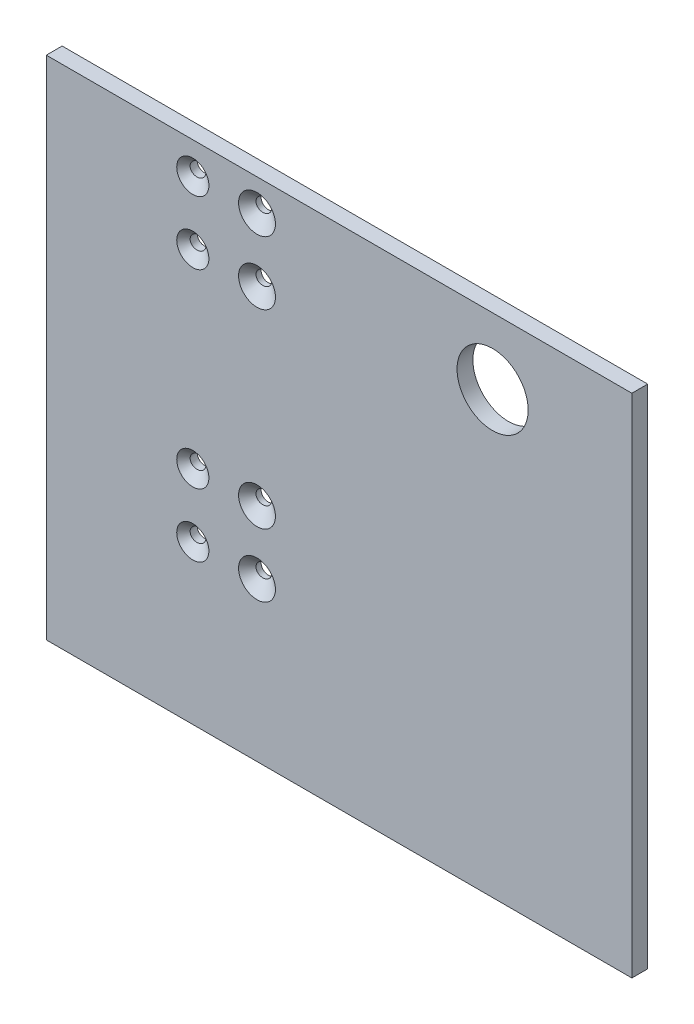
ISO-10303-21;
HEADER;
FILE_DESCRIPTION(('STEP AP214'),'2;1');
FILE_NAME('part.step','',(''),(''),'','','');
FILE_SCHEMA(('AUTOMOTIVE_DESIGN { 1 0 10303 214 1 1 1 1 }'));
ENDSEC;
DATA;
#1=APPLICATION_CONTEXT('core data for automotive mechanical design processes');
#2=APPLICATION_PROTOCOL_DEFINITION('international standard','automotive_design',2000,#1);
#3=PRODUCT_CONTEXT('',#1,'mechanical');
#4=PRODUCT('Part','Part','',(#3));
#5=PRODUCT_RELATED_PRODUCT_CATEGORY('part','',(#4));
#6=PRODUCT_DEFINITION_FORMATION('','',#4);
#7=PRODUCT_DEFINITION_CONTEXT('part definition',#1,'design');
#8=PRODUCT_DEFINITION('design','',#6,#7);
#9=PRODUCT_DEFINITION_SHAPE('','',#8);
#10=(LENGTH_UNIT() NAMED_UNIT(*) SI_UNIT(.MILLI.,.METRE.));
#11=(NAMED_UNIT(*) PLANE_ANGLE_UNIT() SI_UNIT($,.RADIAN.));
#12=(NAMED_UNIT(*) SI_UNIT($,.STERADIAN.) SOLID_ANGLE_UNIT());
#13=UNCERTAINTY_MEASURE_WITH_UNIT(LENGTH_MEASURE(1.E-05),#10,'distance_accuracy_value','');
#14=(GEOMETRIC_REPRESENTATION_CONTEXT(3) GLOBAL_UNCERTAINTY_ASSIGNED_CONTEXT((#13)) GLOBAL_UNIT_ASSIGNED_CONTEXT((#10,
#11,#12)) REPRESENTATION_CONTEXT('',''));
#15=CARTESIAN_POINT('',(0.,0.,0.));
#16=DIRECTION('',(0.,0.,1.));
#17=DIRECTION('',(1.,0.,0.));
#18=AXIS2_PLACEMENT_3D('',#15,#16,#17);
#19=CARTESIAN_POINT('',(117.475,-101.6,6.35));
#20=DIRECTION('',(-1.,0.,0.));
#21=DIRECTION('',(0.,0.,1.));
#22=AXIS2_PLACEMENT_3D('',#19,#20,#21);
#23=PLANE('',#22);
#24=DIRECTION('',(0.,1.,0.));
#25=VECTOR('',#24,1.);
#26=CARTESIAN_POINT('',(117.475,-101.6,0.));
#27=LINE('',#26,#25);
#28=CARTESIAN_POINT('',(117.475,-101.6,0.));
#29=VERTEX_POINT('',#28);
#30=CARTESIAN_POINT('',(117.475,101.6,0.));
#31=VERTEX_POINT('',#30);
#32=EDGE_CURVE('E107',#29,#31,#27,.T.);
#33=ORIENTED_EDGE('',*,*,#32,.T.);
#34=DIRECTION('',(0.,0.,-1.));
#35=VECTOR('',#34,1.);
#36=CARTESIAN_POINT('',(117.475,101.6,6.35));
#37=LINE('',#36,#35);
#38=CARTESIAN_POINT('',(117.475,101.6,6.35));
#39=VERTEX_POINT('',#38);
#40=EDGE_CURVE('E11',#39,#31,#37,.T.);
#41=ORIENTED_EDGE('',*,*,#40,.F.);
#42=DIRECTION('',(0.,1.,0.));
#43=VECTOR('',#42,1.);
#44=CARTESIAN_POINT('',(117.475,-101.6,6.35));
#45=LINE('',#44,#43);
#46=CARTESIAN_POINT('',(117.475,-101.6,6.35));
#47=VERTEX_POINT('',#46);
#48=EDGE_CURVE('E94',#47,#39,#45,.T.);
#49=ORIENTED_EDGE('',*,*,#48,.F.);
#50=DIRECTION('',(0.,0.,-1.));
#51=VECTOR('',#50,1.);
#52=CARTESIAN_POINT('',(117.475,-101.6,6.35));
#53=LINE('',#52,#51);
#54=EDGE_CURVE('E103',#47,#29,#53,.T.);
#55=ORIENTED_EDGE('',*,*,#54,.T.);
#56=EDGE_LOOP('',(#33,#41,#49,#55));
#57=FACE_BOUND('',#56,.T.);
#58=ADVANCED_FACE('F41',(#57),#23,.F.);
#59=CARTESIAN_POINT('',(-117.475,101.6,6.35));
#60=DIRECTION('',(0.,-1.,0.));
#61=DIRECTION('',(0.,0.,-1.));
#62=AXIS2_PLACEMENT_3D('',#59,#60,#61);
#63=PLANE('',#62);
#64=DIRECTION('',(-1.,0.,0.));
#65=VECTOR('',#64,1.);
#66=CARTESIAN_POINT('',(-117.475,101.6,0.));
#67=LINE('',#66,#65);
#68=CARTESIAN_POINT('',(-117.475,101.6,0.));
#69=VERTEX_POINT('',#68);
#70=EDGE_CURVE('E98',#31,#69,#67,.T.);
#71=ORIENTED_EDGE('',*,*,#70,.T.);
#72=DIRECTION('',(0.,0.,-1.));
#73=VECTOR('',#72,1.);
#74=CARTESIAN_POINT('',(-117.475,101.6,6.35));
#75=LINE('',#74,#73);
#76=CARTESIAN_POINT('',(-117.475,101.6,6.35));
#77=VERTEX_POINT('',#76);
#78=EDGE_CURVE('E50',#77,#69,#75,.T.);
#79=ORIENTED_EDGE('',*,*,#78,.F.);
#80=DIRECTION('',(-1.,0.,0.));
#81=VECTOR('',#80,1.);
#82=CARTESIAN_POINT('',(-117.475,101.6,6.35));
#83=LINE('',#82,#81);
#84=EDGE_CURVE('E89',#39,#77,#83,.T.);
#85=ORIENTED_EDGE('',*,*,#84,.F.);
#86=ORIENTED_EDGE('',*,*,#40,.T.);
#87=EDGE_LOOP('',(#71,#79,#85,#86));
#88=FACE_BOUND('',#87,.T.);
#89=ADVANCED_FACE('F97',(#88),#63,.F.);
#90=CARTESIAN_POINT('',(-117.475,-101.6,6.35));
#91=DIRECTION('',(1.,0.,0.));
#92=DIRECTION('',(0.,0.,-1.));
#93=AXIS2_PLACEMENT_3D('',#90,#91,#92);
#94=PLANE('',#93);
#95=DIRECTION('',(0.,-1.,0.));
#96=VECTOR('',#95,1.);
#97=CARTESIAN_POINT('',(-117.475,-101.6,0.));
#98=LINE('',#97,#96);
#99=CARTESIAN_POINT('',(-117.475,-101.6,0.));
#100=VERTEX_POINT('',#99);
#101=EDGE_CURVE('E76',#69,#100,#98,.T.);
#102=ORIENTED_EDGE('',*,*,#101,.T.);
#103=DIRECTION('',(0.,0.,-1.));
#104=VECTOR('',#103,1.);
#105=CARTESIAN_POINT('',(-117.475,-101.6,6.35));
#106=LINE('',#105,#104);
#107=CARTESIAN_POINT('',(-117.475,-101.6,6.35));
#108=VERTEX_POINT('',#107);
#109=EDGE_CURVE('E99',#108,#100,#106,.T.);
#110=ORIENTED_EDGE('',*,*,#109,.F.);
#111=DIRECTION('',(0.,-1.,0.));
#112=VECTOR('',#111,1.);
#113=CARTESIAN_POINT('',(-117.475,-101.6,6.35));
#114=LINE('',#113,#112);
#115=EDGE_CURVE('E92',#77,#108,#114,.T.);
#116=ORIENTED_EDGE('',*,*,#115,.F.);
#117=ORIENTED_EDGE('',*,*,#78,.T.);
#118=EDGE_LOOP('',(#102,#110,#116,#117));
#119=FACE_BOUND('',#118,.T.);
#120=ADVANCED_FACE('F101',(#119),#94,.F.);
#121=CARTESIAN_POINT('',(-117.475,-101.6,6.35));
#122=DIRECTION('',(0.,1.,0.));
#123=DIRECTION('',(0.,0.,1.));
#124=AXIS2_PLACEMENT_3D('',#121,#122,#123);
#125=PLANE('',#124);
#126=DIRECTION('',(1.,0.,0.));
#127=VECTOR('',#126,1.);
#128=CARTESIAN_POINT('',(-117.475,-101.6,0.));
#129=LINE('',#128,#127);
#130=EDGE_CURVE('E82',#100,#29,#129,.T.);
#131=ORIENTED_EDGE('',*,*,#130,.T.);
#132=ORIENTED_EDGE('',*,*,#54,.F.);
#133=DIRECTION('',(1.,0.,0.));
#134=VECTOR('',#133,1.);
#135=CARTESIAN_POINT('',(-117.475,-101.6,6.35));
#136=LINE('',#135,#134);
#137=EDGE_CURVE('E59',#108,#47,#136,.T.);
#138=ORIENTED_EDGE('',*,*,#137,.F.);
#139=ORIENTED_EDGE('',*,*,#109,.T.);
#140=EDGE_LOOP('',(#131,#132,#138,#139));
#141=FACE_BOUND('',#140,.T.);
#142=ADVANCED_FACE('F199',(#141),#125,.F.);
#143=CARTESIAN_POINT('',(0.,0.,6.35));
#144=DIRECTION('',(0.,0.,-1.));
#145=DIRECTION('',(-1.,0.,0.));
#146=AXIS2_PLACEMENT_3D('',#143,#144,#145);
#147=PLANE('',#146);
#148=CARTESIAN_POINT('',(-32.9289390059035,-12.6999999999791,6.35));
#149=DIRECTION('',(0.,0.,-1.));
#150=DIRECTION('',(1.,0.,0.));
#151=AXIS2_PLACEMENT_3D('',#148,#149,#150);
#152=ELLIPSE('',#151,7.39481340715656,7.25902315022984);
#153=CARTESIAN_POINT('',(-25.5341255987469,-12.6999999999791,6.35));
#154=VERTEX_POINT('',#153);
#155=EDGE_CURVE('E44',#154,#154,#152,.T.);
#156=ORIENTED_EDGE('',*,*,#155,.T.);
#157=EDGE_LOOP('',(#156));
#158=FACE_BOUND('',#157,.T.);
#159=CARTESIAN_POINT('',(-32.9289390059035,-38.0999999999791,6.35));
#160=DIRECTION('',(0.,0.,-1.));
#161=DIRECTION('',(1.,0.,0.));
#162=AXIS2_PLACEMENT_3D('',#159,#160,#161);
#163=ELLIPSE('',#162,7.39481340715651,7.25902315022979);
#164=CARTESIAN_POINT('',(-25.534125598747,-38.0999999999791,6.35));
#165=VERTEX_POINT('',#164);
#166=EDGE_CURVE('E162',#165,#165,#163,.T.);
#167=ORIENTED_EDGE('',*,*,#166,.T.);
#168=EDGE_LOOP('',(#167));
#169=FACE_BOUND('',#168,.T.);
#170=CARTESIAN_POINT('',(-32.9289390059034,63.5000000000017,6.35));
#171=DIRECTION('',(0.,0.,-1.));
#172=DIRECTION('',(1.,0.,0.));
#173=AXIS2_PLACEMENT_3D('',#170,#171,#172);
#174=ELLIPSE('',#173,7.39481340715672,7.25902315023);
#175=CARTESIAN_POINT('',(-25.5341255987467,63.5000000000017,6.35));
#176=VERTEX_POINT('',#175);
#177=EDGE_CURVE('E155',#176,#176,#174,.T.);
#178=ORIENTED_EDGE('',*,*,#177,.T.);
#179=EDGE_LOOP('',(#178));
#180=FACE_BOUND('',#179,.T.);
#181=CARTESIAN_POINT('',(-32.9289390059034,88.9000000000018,6.35));
#182=DIRECTION('',(0.,0.,-1.));
#183=DIRECTION('',(1.,0.,0.));
#184=AXIS2_PLACEMENT_3D('',#181,#182,#183);
#185=ELLIPSE('',#184,7.39481340715677,7.25902315023005);
#186=CARTESIAN_POINT('',(-25.5341255987467,88.9000000000018,6.35));
#187=VERTEX_POINT('',#186);
#188=EDGE_CURVE('E148',#187,#187,#185,.T.);
#189=ORIENTED_EDGE('',*,*,#188,.T.);
#190=EDGE_LOOP('',(#189));
#191=FACE_BOUND('',#190,.T.);
#192=CARTESIAN_POINT('',(-58.6916695251732,-38.0999999999791,6.35));
#193=DIRECTION('',(0.,0.,-1.));
#194=DIRECTION('',(1.,0.,0.));
#195=AXIS2_PLACEMENT_3D('',#192,#193,#194);
#196=ELLIPSE('',#195,6.45115062140423,6.3326887546713);
#197=CARTESIAN_POINT('',(-52.240518903769,-38.0999999999791,6.35));
#198=VERTEX_POINT('',#197);
#199=EDGE_CURVE('E141',#198,#198,#196,.T.);
#200=ORIENTED_EDGE('',*,*,#199,.T.);
#201=EDGE_LOOP('',(#200));
#202=FACE_BOUND('',#201,.T.);
#203=CARTESIAN_POINT('',(-58.6916695251732,-12.6999999999791,6.35));
#204=DIRECTION('',(0.,0.,-1.));
#205=DIRECTION('',(1.,0.,0.));
#206=AXIS2_PLACEMENT_3D('',#203,#204,#205);
#207=ELLIPSE('',#206,6.45115062140428,6.33268875467135);
#208=CARTESIAN_POINT('',(-52.2405189037689,-12.6999999999791,6.35));
#209=VERTEX_POINT('',#208);
#210=EDGE_CURVE('E134',#209,#209,#207,.T.);
#211=ORIENTED_EDGE('',*,*,#210,.T.);
#212=EDGE_LOOP('',(#211));
#213=FACE_BOUND('',#212,.T.);
#214=CARTESIAN_POINT('',(-58.6916695251731,63.5000000000017,6.35));
#215=DIRECTION('',(0.,0.,-1.));
#216=DIRECTION('',(1.,0.,0.));
#217=AXIS2_PLACEMENT_3D('',#214,#215,#216);
#218=ELLIPSE('',#217,6.45115062140444,6.33268875467151);
#219=CARTESIAN_POINT('',(-52.2405189037687,63.5000000000017,6.35));
#220=VERTEX_POINT('',#219);
#221=EDGE_CURVE('E127',#220,#220,#218,.T.);
#222=ORIENTED_EDGE('',*,*,#221,.T.);
#223=EDGE_LOOP('',(#222));
#224=FACE_BOUND('',#223,.T.);
#225=CARTESIAN_POINT('',(-58.6916695251731,88.9000000000017,6.35));
#226=DIRECTION('',(0.,0.,-1.));
#227=DIRECTION('',(1.,0.,0.));
#228=AXIS2_PLACEMENT_3D('',#225,#226,#227);
#229=ELLIPSE('',#228,6.45115062140449,6.33268875467156);
#230=CARTESIAN_POINT('',(-52.2405189037686,88.9000000000017,6.35));
#231=VERTEX_POINT('',#230);
#232=EDGE_CURVE('E116',#231,#231,#229,.T.);
#233=ORIENTED_EDGE('',*,*,#232,.T.);
#234=EDGE_LOOP('',(#233));
#235=FACE_BOUND('',#234,.T.);
#236=CARTESIAN_POINT('',(61.595,74.93,6.35));
#237=DIRECTION('',(0.,0.,1.));
#238=DIRECTION('',(1.,0.,0.));
#239=AXIS2_PLACEMENT_3D('',#236,#237,#238);
#240=CIRCLE('',#239,14.2748);
#241=CARTESIAN_POINT('',(75.8698,74.93,6.35));
#242=VERTEX_POINT('',#241);
#243=EDGE_CURVE('E123',#242,#242,#240,.T.);
#244=ORIENTED_EDGE('',*,*,#243,.F.);
#245=EDGE_LOOP('',(#244));
#246=FACE_BOUND('',#245,.T.);
#247=ORIENTED_EDGE('',*,*,#48,.T.);
#248=ORIENTED_EDGE('',*,*,#84,.T.);
#249=ORIENTED_EDGE('',*,*,#115,.T.);
#250=ORIENTED_EDGE('',*,*,#137,.T.);
#251=EDGE_LOOP('',(#247,#248,#249,#250));
#252=FACE_BOUND('',#251,.T.);
#253=ADVANCED_FACE('F90',(#158,#169,#180,#191,#202,#213,#224,#235,#246,#252),#147,.F.);
#254=CARTESIAN_POINT('',(0.,0.,0.));
#255=DIRECTION('',(0.,0.,-1.));
#256=DIRECTION('',(-1.,0.,0.));
#257=AXIS2_PLACEMENT_3D('',#254,#255,#256);
#258=PLANE('',#257);
#259=CARTESIAN_POINT('',(-34.8000253723395,-12.6999999999791,0.));
#260=DIRECTION('',(0.,0.,-1.));
#261=DIRECTION('',(1.,0.,0.));
#262=AXIS2_PLACEMENT_3D('',#259,#260,#261);
#263=ELLIPSE('',#262,2.83258676501395,2.80669999999999);
#264=CARTESIAN_POINT('',(-31.9674386073256,-12.6999999999791,0.));
#265=VERTEX_POINT('',#264);
#266=EDGE_CURVE('E165',#265,#265,#263,.T.);
#267=ORIENTED_EDGE('',*,*,#266,.F.);
#268=EDGE_LOOP('',(#267));
#269=FACE_BOUND('',#268,.T.);
#270=CARTESIAN_POINT('',(-34.8000253723395,-38.0999999999791,0.));
#271=DIRECTION('',(0.,0.,-1.));
#272=DIRECTION('',(1.,0.,0.));
#273=AXIS2_PLACEMENT_3D('',#270,#271,#272);
#274=ELLIPSE('',#273,2.83258676501395,2.80669999999999);
#275=CARTESIAN_POINT('',(-31.9674386073256,-38.0999999999791,0.));
#276=VERTEX_POINT('',#275);
#277=EDGE_CURVE('E159',#276,#276,#274,.T.);
#278=ORIENTED_EDGE('',*,*,#277,.F.);
#279=EDGE_LOOP('',(#278));
#280=FACE_BOUND('',#279,.T.);
#281=CARTESIAN_POINT('',(-34.8000253723395,63.5000000000017,0.));
#282=DIRECTION('',(0.,0.,-1.));
#283=DIRECTION('',(1.,0.,0.));
#284=AXIS2_PLACEMENT_3D('',#281,#282,#283);
#285=ELLIPSE('',#284,2.83258676501395,2.8067);
#286=CARTESIAN_POINT('',(-31.9674386073255,63.5000000000017,0.));
#287=VERTEX_POINT('',#286);
#288=EDGE_CURVE('E152',#287,#287,#285,.T.);
#289=ORIENTED_EDGE('',*,*,#288,.F.);
#290=EDGE_LOOP('',(#289));
#291=FACE_BOUND('',#290,.T.);
#292=CARTESIAN_POINT('',(-34.8000253723395,88.9000000000018,0.));
#293=DIRECTION('',(0.,0.,-1.));
#294=DIRECTION('',(1.,0.,0.));
#295=AXIS2_PLACEMENT_3D('',#292,#293,#294);
#296=ELLIPSE('',#295,2.83258676501395,2.8067);
#297=CARTESIAN_POINT('',(-31.9674386073255,88.9000000000018,0.));
#298=VERTEX_POINT('',#297);
#299=EDGE_CURVE('E145',#298,#298,#296,.T.);
#300=ORIENTED_EDGE('',*,*,#299,.F.);
#301=EDGE_LOOP('',(#300));
#302=FACE_BOUND('',#301,.T.);
#303=CARTESIAN_POINT('',(-60.4342947389817,-38.0999999999791,0.));
#304=DIRECTION('',(0.,0.,-1.));
#305=DIRECTION('',(1.,0.,0.));
#306=AXIS2_PLACEMENT_3D('',#303,#304,#305);
#307=ELLIPSE('',#306,2.83258676501395,2.80669999999999);
#308=CARTESIAN_POINT('',(-57.6017079739677,-38.0999999999791,0.));
#309=VERTEX_POINT('',#308);
#310=EDGE_CURVE('E138',#309,#309,#307,.T.);
#311=ORIENTED_EDGE('',*,*,#310,.F.);
#312=EDGE_LOOP('',(#311));
#313=FACE_BOUND('',#312,.T.);
#314=CARTESIAN_POINT('',(-60.4342947389816,-12.6999999999791,0.));
#315=DIRECTION('',(0.,0.,-1.));
#316=DIRECTION('',(1.,0.,0.));
#317=AXIS2_PLACEMENT_3D('',#314,#315,#316);
#318=ELLIPSE('',#317,2.83258676501395,2.80669999999999);
#319=CARTESIAN_POINT('',(-57.6017079739677,-12.6999999999791,0.));
#320=VERTEX_POINT('',#319);
#321=EDGE_CURVE('E131',#320,#320,#318,.T.);
#322=ORIENTED_EDGE('',*,*,#321,.F.);
#323=EDGE_LOOP('',(#322));
#324=FACE_BOUND('',#323,.T.);
#325=CARTESIAN_POINT('',(-60.4342947389816,63.5000000000017,0.));
#326=DIRECTION('',(0.,0.,-1.));
#327=DIRECTION('',(1.,0.,0.));
#328=AXIS2_PLACEMENT_3D('',#325,#326,#327);
#329=ELLIPSE('',#328,2.83258676501395,2.8067);
#330=CARTESIAN_POINT('',(-57.6017079739677,63.5000000000017,0.));
#331=VERTEX_POINT('',#330);
#332=EDGE_CURVE('E124',#331,#331,#329,.T.);
#333=ORIENTED_EDGE('',*,*,#332,.F.);
#334=EDGE_LOOP('',(#333));
#335=FACE_BOUND('',#334,.T.);
#336=CARTESIAN_POINT('',(-60.4342947389816,88.9000000000017,0.));
#337=DIRECTION('',(0.,0.,-1.));
#338=DIRECTION('',(1.,0.,0.));
#339=AXIS2_PLACEMENT_3D('',#336,#337,#338);
#340=ELLIPSE('',#339,2.83258676501395,2.8067);
#341=CARTESIAN_POINT('',(-57.6017079739677,88.9000000000017,0.));
#342=VERTEX_POINT('',#341);
#343=EDGE_CURVE('E119',#342,#342,#340,.T.);
#344=ORIENTED_EDGE('',*,*,#343,.F.);
#345=EDGE_LOOP('',(#344));
#346=FACE_BOUND('',#345,.T.);
#347=CARTESIAN_POINT('',(61.595,74.93,0.));
#348=DIRECTION('',(0.,0.,1.));
#349=DIRECTION('',(1.,0.,0.));
#350=AXIS2_PLACEMENT_3D('',#347,#348,#349);
#351=CIRCLE('',#350,14.2748);
#352=CARTESIAN_POINT('',(75.8698,74.93,0.));
#353=VERTEX_POINT('',#352);
#354=EDGE_CURVE('E110',#353,#353,#351,.T.);
#355=ORIENTED_EDGE('',*,*,#354,.T.);
#356=EDGE_LOOP('',(#355));
#357=FACE_BOUND('',#356,.T.);
#358=ORIENTED_EDGE('',*,*,#32,.F.);
#359=ORIENTED_EDGE('',*,*,#130,.F.);
#360=ORIENTED_EDGE('',*,*,#101,.F.);
#361=ORIENTED_EDGE('',*,*,#70,.F.);
#362=EDGE_LOOP('',(#358,#359,#360,#361));
#363=FACE_BOUND('',#362,.T.);
#364=ADVANCED_FACE('F198',(#269,#280,#291,#302,#313,#324,#335,#346,#357,#363),#258,.T.);
#365=CARTESIAN_POINT('',(61.595,74.93,0.));
#366=DIRECTION('',(0.,0.,1.));
#367=DIRECTION('',(1.,0.,0.));
#368=AXIS2_PLACEMENT_3D('',#365,#366,#367);
#369=CYLINDRICAL_SURFACE('',#368,14.2748);
#370=ORIENTED_EDGE('',*,*,#354,.F.);
#371=EDGE_LOOP('',(#370));
#372=FACE_BOUND('',#371,.T.);
#373=ORIENTED_EDGE('',*,*,#243,.T.);
#374=EDGE_LOOP('',(#373));
#375=FACE_BOUND('',#374,.T.);
#376=ADVANCED_FACE('F195',(#372,#375),#369,.F.);
#377=CARTESIAN_POINT('',(-59.2169690438166,88.9000000000017,8.9423528683234));
#378=DIRECTION('',(0.134886274213767,0.,0.990861086645716));
#379=DIRECTION('',(0.990861086645716,0.,-0.134886274213767));
#380=AXIS2_PLACEMENT_3D('',#377,#378,#379);
#381=CONICAL_SURFACE('',#380,8.89,0.785398163397448);
#382=CARTESIAN_POINT('',(-60.0375227157412,88.9000000000017,2.91464761993152));
#383=DIRECTION('',(0.134886274213767,0.,0.990861086645716));
#384=DIRECTION('',(0.990861086645716,0.,-0.134886274213767));
#385=AXIS2_PLACEMENT_3D('',#382,#383,#384);
#386=CIRCLE('',#385,2.8067);
#387=CARTESIAN_POINT('',(-57.2564729038527,88.9000000000017,2.53606231409574));
#388=VERTEX_POINT('',#387);
#389=EDGE_CURVE('E120',#388,#388,#386,.T.);
#390=ORIENTED_EDGE('',*,*,#389,.F.);
#391=EDGE_LOOP('',(#390));
#392=FACE_BOUND('',#391,.T.);
#393=ORIENTED_EDGE('',*,*,#232,.F.);
#394=EDGE_LOOP('',(#393));
#395=FACE_BOUND('',#394,.T.);
#396=ADVANCED_FACE('F237',(#392,#395),#381,.F.);
#397=CARTESIAN_POINT('',(-59.2169690438166,88.9000000000017,8.9423528683234));
#398=DIRECTION('',(0.134886274213767,0.,0.990861086645716));
#399=DIRECTION('',(0.990861086645716,0.,-0.134886274213767));
#400=AXIS2_PLACEMENT_3D('',#397,#398,#399);
#401=CYLINDRICAL_SURFACE('',#400,2.8067);
#402=ORIENTED_EDGE('',*,*,#343,.T.);
#403=EDGE_LOOP('',(#402));
#404=FACE_BOUND('',#403,.T.);
#405=ORIENTED_EDGE('',*,*,#389,.T.);
#406=EDGE_LOOP('',(#405));
#407=FACE_BOUND('',#406,.T.);
#408=ADVANCED_FACE('F246',(#404,#407),#401,.F.);
#409=CARTESIAN_POINT('',(-59.2169690438166,63.5000000000017,8.94235286832345));
#410=DIRECTION('',(0.134886274213767,0.,0.990861086645716));
#411=DIRECTION('',(0.990861086645716,0.,-0.134886274213767));
#412=AXIS2_PLACEMENT_3D('',#409,#410,#411);
#413=CONICAL_SURFACE('',#412,8.89,0.785398163397448);
#414=CARTESIAN_POINT('',(-60.0375227157412,63.5000000000017,2.91464761993157));
#415=DIRECTION('',(0.134886274213767,0.,0.990861086645716));
#416=DIRECTION('',(0.990861086645716,0.,-0.134886274213767));
#417=AXIS2_PLACEMENT_3D('',#414,#415,#416);
#418=CIRCLE('',#417,2.8067);
#419=CARTESIAN_POINT('',(-57.2564729038527,63.5000000000017,2.53606231409579));
#420=VERTEX_POINT('',#419);
#421=EDGE_CURVE('E128',#420,#420,#418,.T.);
#422=ORIENTED_EDGE('',*,*,#421,.F.);
#423=EDGE_LOOP('',(#422));
#424=FACE_BOUND('',#423,.T.);
#425=ORIENTED_EDGE('',*,*,#221,.F.);
#426=EDGE_LOOP('',(#425));
#427=FACE_BOUND('',#426,.T.);
#428=ADVANCED_FACE('F255',(#424,#427),#413,.F.);
#429=CARTESIAN_POINT('',(-59.2169690438166,63.5000000000017,8.94235286832345));
#430=DIRECTION('',(0.134886274213767,0.,0.990861086645716));
#431=DIRECTION('',(0.990861086645716,0.,-0.134886274213767));
#432=AXIS2_PLACEMENT_3D('',#429,#430,#431);
#433=CYLINDRICAL_SURFACE('',#432,2.8067);
#434=ORIENTED_EDGE('',*,*,#332,.T.);
#435=EDGE_LOOP('',(#434));
#436=FACE_BOUND('',#435,.T.);
#437=ORIENTED_EDGE('',*,*,#421,.T.);
#438=EDGE_LOOP('',(#437));
#439=FACE_BOUND('',#438,.T.);
#440=ADVANCED_FACE('F264',(#436,#439),#433,.F.);
#441=CARTESIAN_POINT('',(-59.2169690438166,-12.6999999999791,8.94235286832361));
#442=DIRECTION('',(0.134886274213767,0.,0.990861086645716));
#443=DIRECTION('',(0.990861086645716,0.,-0.134886274213767));
#444=AXIS2_PLACEMENT_3D('',#441,#442,#443);
#445=CONICAL_SURFACE('',#444,8.89,0.785398163397449);
#446=CARTESIAN_POINT('',(-60.0375227157412,-12.6999999999791,2.91464761993173));
#447=DIRECTION('',(0.134886274213767,0.,0.990861086645716));
#448=DIRECTION('',(0.990861086645716,0.,-0.134886274213767));
#449=AXIS2_PLACEMENT_3D('',#446,#447,#448);
#450=CIRCLE('',#449,2.80669999999999);
#451=CARTESIAN_POINT('',(-57.2564729038527,-12.6999999999791,2.53606231409595));
#452=VERTEX_POINT('',#451);
#453=EDGE_CURVE('E135',#452,#452,#450,.T.);
#454=ORIENTED_EDGE('',*,*,#453,.F.);
#455=EDGE_LOOP('',(#454));
#456=FACE_BOUND('',#455,.T.);
#457=ORIENTED_EDGE('',*,*,#210,.F.);
#458=EDGE_LOOP('',(#457));
#459=FACE_BOUND('',#458,.T.);
#460=ADVANCED_FACE('F273',(#456,#459),#445,.F.);
#461=CARTESIAN_POINT('',(-59.2169690438166,-12.6999999999791,8.94235286832361));
#462=DIRECTION('',(0.134886274213767,0.,0.990861086645716));
#463=DIRECTION('',(0.990861086645716,0.,-0.134886274213767));
#464=AXIS2_PLACEMENT_3D('',#461,#462,#463);
#465=CYLINDRICAL_SURFACE('',#464,2.80669999999999);
#466=ORIENTED_EDGE('',*,*,#321,.T.);
#467=EDGE_LOOP('',(#466));
#468=FACE_BOUND('',#467,.T.);
#469=ORIENTED_EDGE('',*,*,#453,.T.);
#470=EDGE_LOOP('',(#469));
#471=FACE_BOUND('',#470,.T.);
#472=ADVANCED_FACE('F282',(#468,#471),#465,.F.);
#473=CARTESIAN_POINT('',(-59.2169690438166,-38.0999999999791,8.94235286832366));
#474=DIRECTION('',(0.134886274213767,0.,0.990861086645716));
#475=DIRECTION('',(0.990861086645716,0.,-0.134886274213767));
#476=AXIS2_PLACEMENT_3D('',#473,#474,#475);
#477=CONICAL_SURFACE('',#476,8.89,0.785398163397449);
#478=CARTESIAN_POINT('',(-60.0375227157412,-38.0999999999791,2.91464761993177));
#479=DIRECTION('',(0.134886274213767,0.,0.990861086645716));
#480=DIRECTION('',(0.990861086645716,0.,-0.134886274213767));
#481=AXIS2_PLACEMENT_3D('',#478,#479,#480);
#482=CIRCLE('',#481,2.80669999999999);
#483=CARTESIAN_POINT('',(-57.2564729038527,-38.0999999999791,2.536062314096));
#484=VERTEX_POINT('',#483);
#485=EDGE_CURVE('E142',#484,#484,#482,.T.);
#486=ORIENTED_EDGE('',*,*,#485,.F.);
#487=EDGE_LOOP('',(#486));
#488=FACE_BOUND('',#487,.T.);
#489=ORIENTED_EDGE('',*,*,#199,.F.);
#490=EDGE_LOOP('',(#489));
#491=FACE_BOUND('',#490,.T.);
#492=ADVANCED_FACE('F291',(#488,#491),#477,.F.);
#493=CARTESIAN_POINT('',(-59.2169690438166,-38.0999999999791,8.94235286832366));
#494=DIRECTION('',(0.134886274213767,0.,0.990861086645716));
#495=DIRECTION('',(0.990861086645716,0.,-0.134886274213767));
#496=AXIS2_PLACEMENT_3D('',#493,#494,#495);
#497=CYLINDRICAL_SURFACE('',#496,2.80669999999999);
#498=ORIENTED_EDGE('',*,*,#310,.T.);
#499=EDGE_LOOP('',(#498));
#500=FACE_BOUND('',#499,.T.);
#501=ORIENTED_EDGE('',*,*,#485,.T.);
#502=EDGE_LOOP('',(#501));
#503=FACE_BOUND('',#502,.T.);
#504=ADVANCED_FACE('F299',(#500,#503),#497,.F.);
#505=CARTESIAN_POINT('',(-33.7064863065125,88.9000000000018,8.03302866337381));
#506=DIRECTION('',(0.134886274213767,0.,0.990861086645716));
#507=DIRECTION('',(0.990861086645716,0.,-0.134886274213767));
#508=AXIS2_PLACEMENT_3D('',#505,#506,#507);
#509=CONICAL_SURFACE('',#508,8.89,0.785398163397448);
#510=CARTESIAN_POINT('',(-34.5270399784371,88.9000000000018,2.00532341498192));
#511=DIRECTION('',(0.134886274213767,0.,0.990861086645716));
#512=DIRECTION('',(0.990861086645716,0.,-0.134886274213767));
#513=AXIS2_PLACEMENT_3D('',#510,#511,#512);
#514=CIRCLE('',#513,2.8067);
#515=CARTESIAN_POINT('',(-31.7459901665485,88.9000000000018,1.62673810914614));
#516=VERTEX_POINT('',#515);
#517=EDGE_CURVE('E149',#516,#516,#514,.T.);
#518=ORIENTED_EDGE('',*,*,#517,.F.);
#519=EDGE_LOOP('',(#518));
#520=FACE_BOUND('',#519,.T.);
#521=ORIENTED_EDGE('',*,*,#188,.F.);
#522=EDGE_LOOP('',(#521));
#523=FACE_BOUND('',#522,.T.);
#524=ADVANCED_FACE('F307',(#520,#523),#509,.F.);
#525=CARTESIAN_POINT('',(-33.7064863065125,88.9000000000018,8.03302866337381));
#526=DIRECTION('',(0.134886274213767,0.,0.990861086645716));
#527=DIRECTION('',(0.990861086645716,0.,-0.134886274213767));
#528=AXIS2_PLACEMENT_3D('',#525,#526,#527);
#529=CYLINDRICAL_SURFACE('',#528,2.8067);
#530=ORIENTED_EDGE('',*,*,#299,.T.);
#531=EDGE_LOOP('',(#530));
#532=FACE_BOUND('',#531,.T.);
#533=ORIENTED_EDGE('',*,*,#517,.T.);
#534=EDGE_LOOP('',(#533));
#535=FACE_BOUND('',#534,.T.);
#536=ADVANCED_FACE('F320',(#532,#535),#529,.F.);
#537=CARTESIAN_POINT('',(-33.7064863065125,63.5000000000017,8.03302866337385));
#538=DIRECTION('',(0.134886274213767,0.,0.990861086645716));
#539=DIRECTION('',(0.990861086645716,0.,-0.134886274213767));
#540=AXIS2_PLACEMENT_3D('',#537,#538,#539);
#541=CONICAL_SURFACE('',#540,8.89,0.785398163397448);
#542=CARTESIAN_POINT('',(-34.5270399784371,63.5000000000017,2.00532341498197));
#543=DIRECTION('',(0.134886274213767,0.,0.990861086645716));
#544=DIRECTION('',(0.990861086645716,0.,-0.134886274213767));
#545=AXIS2_PLACEMENT_3D('',#542,#543,#544);
#546=CIRCLE('',#545,2.8067);
#547=CARTESIAN_POINT('',(-31.7459901665485,63.5000000000017,1.62673810914619));
#548=VERTEX_POINT('',#547);
#549=EDGE_CURVE('E156',#548,#548,#546,.T.);
#550=ORIENTED_EDGE('',*,*,#549,.F.);
#551=EDGE_LOOP('',(#550));
#552=FACE_BOUND('',#551,.T.);
#553=ORIENTED_EDGE('',*,*,#177,.F.);
#554=EDGE_LOOP('',(#553));
#555=FACE_BOUND('',#554,.T.);
#556=ADVANCED_FACE('F330',(#552,#555),#541,.F.);
#557=CARTESIAN_POINT('',(-33.7064863065125,63.5000000000017,8.03302866337385));
#558=DIRECTION('',(0.134886274213767,0.,0.990861086645716));
#559=DIRECTION('',(0.990861086645716,0.,-0.134886274213767));
#560=AXIS2_PLACEMENT_3D('',#557,#558,#559);
#561=CYLINDRICAL_SURFACE('',#560,2.8067);
#562=ORIENTED_EDGE('',*,*,#288,.T.);
#563=EDGE_LOOP('',(#562));
#564=FACE_BOUND('',#563,.T.);
#565=ORIENTED_EDGE('',*,*,#549,.T.);
#566=EDGE_LOOP('',(#565));
#567=FACE_BOUND('',#566,.T.);
#568=ADVANCED_FACE('F340',(#564,#567),#561,.F.);
#569=CARTESIAN_POINT('',(-33.7064863065125,-38.0999999999791,8.03302866337406));
#570=DIRECTION('',(0.134886274213767,0.,0.990861086645716));
#571=DIRECTION('',(0.990861086645716,0.,-0.134886274213767));
#572=AXIS2_PLACEMENT_3D('',#569,#570,#571);
#573=CONICAL_SURFACE('',#572,8.89,0.785398163397449);
#574=CARTESIAN_POINT('',(-34.5270399784371,-38.0999999999791,2.00532341498218));
#575=DIRECTION('',(0.134886274213767,0.,0.990861086645716));
#576=DIRECTION('',(0.990861086645716,0.,-0.134886274213767));
#577=AXIS2_PLACEMENT_3D('',#574,#575,#576);
#578=CIRCLE('',#577,2.80669999999999);
#579=CARTESIAN_POINT('',(-31.7459901665486,-38.0999999999791,1.6267381091464));
#580=VERTEX_POINT('',#579);
#581=EDGE_CURVE('E163',#580,#580,#578,.T.);
#582=ORIENTED_EDGE('',*,*,#581,.F.);
#583=EDGE_LOOP('',(#582));
#584=FACE_BOUND('',#583,.T.);
#585=ORIENTED_EDGE('',*,*,#166,.F.);
#586=EDGE_LOOP('',(#585));
#587=FACE_BOUND('',#586,.T.);
#588=ADVANCED_FACE('F350',(#584,#587),#573,.F.);
#589=CARTESIAN_POINT('',(-33.7064863065125,-38.0999999999791,8.03302866337406));
#590=DIRECTION('',(0.134886274213767,0.,0.990861086645716));
#591=DIRECTION('',(0.990861086645716,0.,-0.134886274213767));
#592=AXIS2_PLACEMENT_3D('',#589,#590,#591);
#593=CYLINDRICAL_SURFACE('',#592,2.80669999999999);
#594=ORIENTED_EDGE('',*,*,#277,.T.);
#595=EDGE_LOOP('',(#594));
#596=FACE_BOUND('',#595,.T.);
#597=ORIENTED_EDGE('',*,*,#581,.T.);
#598=EDGE_LOOP('',(#597));
#599=FACE_BOUND('',#598,.T.);
#600=ADVANCED_FACE('F360',(#596,#599),#593,.F.);
#601=CARTESIAN_POINT('',(-33.7064863065125,-12.6999999999791,8.03302866337401));
#602=DIRECTION('',(0.134886274213767,0.,0.990861086645716));
#603=DIRECTION('',(0.990861086645716,0.,-0.134886274213767));
#604=AXIS2_PLACEMENT_3D('',#601,#602,#603);
#605=CONICAL_SURFACE('',#604,8.89,0.785398163397449);
#606=CARTESIAN_POINT('',(-34.5270399784371,-12.6999999999791,2.00532341498213));
#607=DIRECTION('',(0.134886274213767,0.,0.990861086645716));
#608=DIRECTION('',(0.990861086645716,0.,-0.134886274213767));
#609=AXIS2_PLACEMENT_3D('',#606,#607,#608);
#610=CIRCLE('',#609,2.80669999999999);
#611=CARTESIAN_POINT('',(-31.7459901665486,-12.6999999999791,1.62673810914635));
#612=VERTEX_POINT('',#611);
#613=EDGE_CURVE('E167',#612,#612,#610,.T.);
#614=ORIENTED_EDGE('',*,*,#613,.F.);
#615=EDGE_LOOP('',(#614));
#616=FACE_BOUND('',#615,.T.);
#617=ORIENTED_EDGE('',*,*,#155,.F.);
#618=EDGE_LOOP('',(#617));
#619=FACE_BOUND('',#618,.T.);
#620=ADVANCED_FACE('F370',(#616,#619),#605,.F.);
#621=CARTESIAN_POINT('',(-33.7064863065125,-12.6999999999791,8.03302866337401));
#622=DIRECTION('',(0.134886274213767,0.,0.990861086645716));
#623=DIRECTION('',(0.990861086645716,0.,-0.134886274213767));
#624=AXIS2_PLACEMENT_3D('',#621,#622,#623);
#625=CYLINDRICAL_SURFACE('',#624,2.80669999999999);
#626=ORIENTED_EDGE('',*,*,#266,.T.);
#627=EDGE_LOOP('',(#626));
#628=FACE_BOUND('',#627,.T.);
#629=ORIENTED_EDGE('',*,*,#613,.T.);
#630=EDGE_LOOP('',(#629));
#631=FACE_BOUND('',#630,.T.);
#632=ADVANCED_FACE('F380',(#628,#631),#625,.F.);
#633=CLOSED_SHELL('',(#58,#89,#120,#142,#253,#364,#376,#396,#408,#428,#440,#460,#472,#492,#504,
#524,#536,#556,#568,#588,#600,#620,#632));
#634=MANIFOLD_SOLID_BREP('B2',#633);
#635=ADVANCED_BREP_SHAPE_REPRESENTATION('',(#18,#634),#14);
#636=SHAPE_DEFINITION_REPRESENTATION(#9,#635);
ENDSEC;
END-ISO-10303-21;
